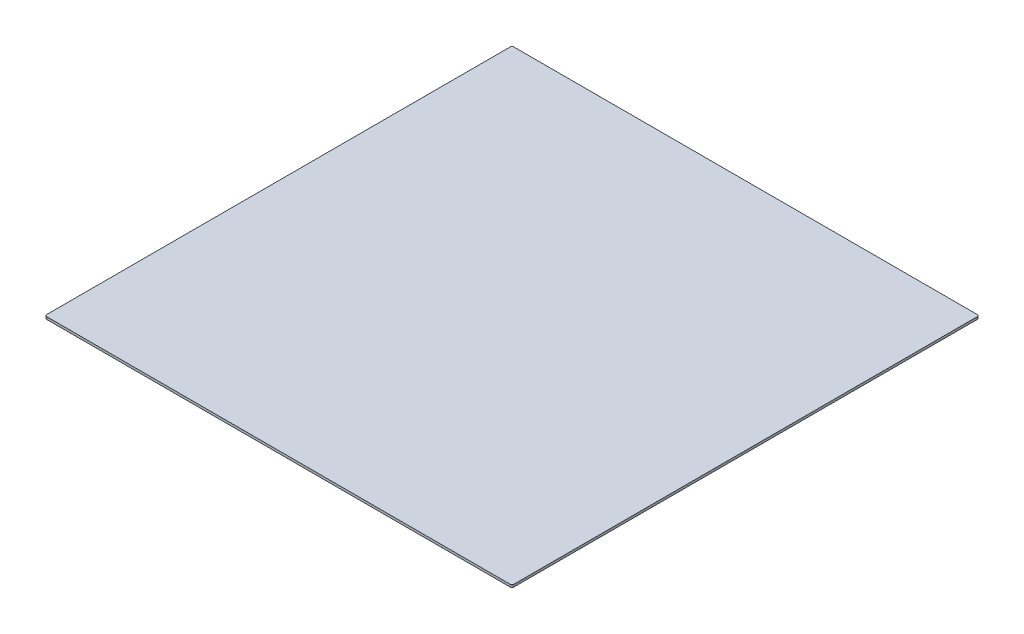
ISO-10303-21;
HEADER;
FILE_DESCRIPTION(('STEP AP214'),'2;1');
FILE_NAME('part.step','',(''),(''),'','','');
FILE_SCHEMA(('AUTOMOTIVE_DESIGN { 1 0 10303 214 1 1 1 1 }'));
ENDSEC;
DATA;
#1=APPLICATION_CONTEXT('core data for automotive mechanical design processes');
#2=APPLICATION_PROTOCOL_DEFINITION('international standard','automotive_design',2000,#1);
#3=PRODUCT_CONTEXT('',#1,'mechanical');
#4=PRODUCT('Part','Part','',(#3));
#5=PRODUCT_RELATED_PRODUCT_CATEGORY('part','',(#4));
#6=PRODUCT_DEFINITION_FORMATION('','',#4);
#7=PRODUCT_DEFINITION_CONTEXT('part definition',#1,'design');
#8=PRODUCT_DEFINITION('design','',#6,#7);
#9=PRODUCT_DEFINITION_SHAPE('','',#8);
#10=(LENGTH_UNIT() NAMED_UNIT(*) SI_UNIT(.MILLI.,.METRE.));
#11=(NAMED_UNIT(*) PLANE_ANGLE_UNIT() SI_UNIT($,.RADIAN.));
#12=(NAMED_UNIT(*) SI_UNIT($,.STERADIAN.) SOLID_ANGLE_UNIT());
#13=UNCERTAINTY_MEASURE_WITH_UNIT(LENGTH_MEASURE(1.E-05),#10,'distance_accuracy_value','');
#14=(GEOMETRIC_REPRESENTATION_CONTEXT(3) GLOBAL_UNCERTAINTY_ASSIGNED_CONTEXT((#13)) GLOBAL_UNIT_ASSIGNED_CONTEXT((#10,
#11,#12)) REPRESENTATION_CONTEXT('',''));
#15=CARTESIAN_POINT('',(0.,0.,0.));
#16=DIRECTION('',(0.,0.,1.));
#17=DIRECTION('',(1.,0.,0.));
#18=AXIS2_PLACEMENT_3D('',#15,#16,#17);
#19=CARTESIAN_POINT('',(1219.2,12.7,-1219.2));
#20=DIRECTION('',(-1.,0.,0.));
#21=DIRECTION('',(0.,0.,1.));
#22=AXIS2_PLACEMENT_3D('',#19,#20,#21);
#23=PLANE('',#22);
#24=DIRECTION('',(0.,0.,-1.));
#25=VECTOR('',#24,1.);
#26=CARTESIAN_POINT('',(1219.2,0.,-1219.2));
#27=LINE('',#26,#25);
#28=CARTESIAN_POINT('',(1219.2,0.,1209.2));
#29=VERTEX_POINT('',#28);
#30=CARTESIAN_POINT('',(1219.2,0.,-1209.2));
#31=VERTEX_POINT('',#30);
#32=EDGE_CURVE('E138',#29,#31,#27,.T.);
#33=ORIENTED_EDGE('',*,*,#32,.T.);
#34=DIRECTION('',(0.,-1.,0.));
#35=VECTOR('',#34,1.);
#36=CARTESIAN_POINT('',(1219.2,12.7,-1209.2));
#37=LINE('',#36,#35);
#38=CARTESIAN_POINT('',(1219.2,12.7,-1209.2));
#39=VERTEX_POINT('',#38);
#40=EDGE_CURVE('E160',#31,#39,#37,.F.);
#41=ORIENTED_EDGE('',*,*,#40,.T.);
#42=DIRECTION('',(0.,0.,-1.));
#43=VECTOR('',#42,1.);
#44=CARTESIAN_POINT('',(1219.2,12.7,-1219.2));
#45=LINE('',#44,#43);
#46=CARTESIAN_POINT('',(1219.2,12.7,1209.2));
#47=VERTEX_POINT('',#46);
#48=EDGE_CURVE('E136',#47,#39,#45,.T.);
#49=ORIENTED_EDGE('',*,*,#48,.F.);
#50=DIRECTION('',(0.,-1.,0.));
#51=VECTOR('',#50,1.);
#52=CARTESIAN_POINT('',(1219.2,12.7,1209.2));
#53=LINE('',#52,#51);
#54=EDGE_CURVE('E157',#47,#29,#53,.T.);
#55=ORIENTED_EDGE('',*,*,#54,.T.);
#56=EDGE_LOOP('',(#33,#41,#49,#55));
#57=FACE_BOUND('',#56,.T.);
#58=ADVANCED_FACE('F41',(#57),#23,.F.);
#59=CARTESIAN_POINT('',(-1219.2,12.7,-1219.2));
#60=DIRECTION('',(0.,0.,1.));
#61=DIRECTION('',(1.,0.,0.));
#62=AXIS2_PLACEMENT_3D('',#59,#60,#61);
#63=PLANE('',#62);
#64=DIRECTION('',(-1.,0.,0.));
#65=VECTOR('',#64,1.);
#66=CARTESIAN_POINT('',(-1219.2,0.,-1219.2));
#67=LINE('',#66,#65);
#68=CARTESIAN_POINT('',(1209.2,0.,-1219.2));
#69=VERTEX_POINT('',#68);
#70=CARTESIAN_POINT('',(-1209.2,0.,-1219.2));
#71=VERTEX_POINT('',#70);
#72=EDGE_CURVE('E134',#69,#71,#67,.T.);
#73=ORIENTED_EDGE('',*,*,#72,.T.);
#74=DIRECTION('',(0.,-1.,0.));
#75=VECTOR('',#74,1.);
#76=CARTESIAN_POINT('',(-1209.2,12.7,-1219.2));
#77=LINE('',#76,#75);
#78=CARTESIAN_POINT('',(-1209.2,12.7,-1219.2));
#79=VERTEX_POINT('',#78);
#80=EDGE_CURVE('E112',#71,#79,#77,.F.);
#81=ORIENTED_EDGE('',*,*,#80,.T.);
#82=DIRECTION('',(-1.,0.,0.));
#83=VECTOR('',#82,1.);
#84=CARTESIAN_POINT('',(-1219.2,12.7,-1219.2));
#85=LINE('',#84,#83);
#86=CARTESIAN_POINT('',(1209.2,12.7,-1219.2));
#87=VERTEX_POINT('',#86);
#88=EDGE_CURVE('E174',#87,#79,#85,.T.);
#89=ORIENTED_EDGE('',*,*,#88,.F.);
#90=DIRECTION('',(0.,-1.,0.));
#91=VECTOR('',#90,1.);
#92=CARTESIAN_POINT('',(1209.2,12.7,-1219.2));
#93=LINE('',#92,#91);
#94=EDGE_CURVE('E117',#87,#69,#93,.T.);
#95=ORIENTED_EDGE('',*,*,#94,.T.);
#96=EDGE_LOOP('',(#73,#81,#89,#95));
#97=FACE_BOUND('',#96,.T.);
#98=ADVANCED_FACE('F179',(#97),#63,.F.);
#99=CARTESIAN_POINT('',(-1219.2,12.7,-1219.2));
#100=DIRECTION('',(1.,0.,0.));
#101=DIRECTION('',(0.,0.,-1.));
#102=AXIS2_PLACEMENT_3D('',#99,#100,#101);
#103=PLANE('',#102);
#104=DIRECTION('',(0.,0.,1.));
#105=VECTOR('',#104,1.);
#106=CARTESIAN_POINT('',(-1219.2,12.7,-1219.2));
#107=LINE('',#106,#105);
#108=CARTESIAN_POINT('',(-1219.2,12.7,-1209.2));
#109=VERTEX_POINT('',#108);
#110=CARTESIAN_POINT('',(-1219.2,12.7,1209.2));
#111=VERTEX_POINT('',#110);
#112=EDGE_CURVE('E126',#109,#111,#107,.T.);
#113=ORIENTED_EDGE('',*,*,#112,.F.);
#114=DIRECTION('',(0.,-1.,0.));
#115=VECTOR('',#114,1.);
#116=CARTESIAN_POINT('',(-1219.2,12.7,-1209.2));
#117=LINE('',#116,#115);
#118=CARTESIAN_POINT('',(-1219.2,0.,-1209.2));
#119=VERTEX_POINT('',#118);
#120=EDGE_CURVE('E111',#109,#119,#117,.T.);
#121=ORIENTED_EDGE('',*,*,#120,.T.);
#122=DIRECTION('',(0.,0.,1.));
#123=VECTOR('',#122,1.);
#124=CARTESIAN_POINT('',(-1219.2,0.,-1219.2));
#125=LINE('',#124,#123);
#126=CARTESIAN_POINT('',(-1219.2,0.,1209.2));
#127=VERTEX_POINT('',#126);
#128=EDGE_CURVE('E124',#119,#127,#125,.T.);
#129=ORIENTED_EDGE('',*,*,#128,.T.);
#130=DIRECTION('',(0.,-1.,0.));
#131=VECTOR('',#130,1.);
#132=CARTESIAN_POINT('',(-1219.2,12.7,1209.2));
#133=LINE('',#132,#131);
#134=EDGE_CURVE('E128',#127,#111,#133,.F.);
#135=ORIENTED_EDGE('',*,*,#134,.T.);
#136=EDGE_LOOP('',(#113,#121,#129,#135));
#137=FACE_BOUND('',#136,.T.);
#138=ADVANCED_FACE('F123',(#137),#103,.F.);
#139=CARTESIAN_POINT('',(-1219.2,12.7,1219.2));
#140=DIRECTION('',(0.,0.,-1.));
#141=DIRECTION('',(-1.,0.,0.));
#142=AXIS2_PLACEMENT_3D('',#139,#140,#141);
#143=PLANE('',#142);
#144=DIRECTION('',(1.,0.,0.));
#145=VECTOR('',#144,1.);
#146=CARTESIAN_POINT('',(-1219.2,12.7,1219.2));
#147=LINE('',#146,#145);
#148=CARTESIAN_POINT('',(-1209.2,12.7,1219.2));
#149=VERTEX_POINT('',#148);
#150=CARTESIAN_POINT('',(1209.2,12.7,1219.2));
#151=VERTEX_POINT('',#150);
#152=EDGE_CURVE('E142',#149,#151,#147,.T.);
#153=ORIENTED_EDGE('',*,*,#152,.F.);
#154=DIRECTION('',(0.,-1.,0.));
#155=VECTOR('',#154,1.);
#156=CARTESIAN_POINT('',(-1209.2,12.7,1219.2));
#157=LINE('',#156,#155);
#158=CARTESIAN_POINT('',(-1209.2,0.,1219.2));
#159=VERTEX_POINT('',#158);
#160=EDGE_CURVE('E11',#149,#159,#157,.T.);
#161=ORIENTED_EDGE('',*,*,#160,.T.);
#162=DIRECTION('',(1.,0.,0.));
#163=VECTOR('',#162,1.);
#164=CARTESIAN_POINT('',(-1219.2,0.,1219.2));
#165=LINE('',#164,#163);
#166=CARTESIAN_POINT('',(1209.2,0.,1219.2));
#167=VERTEX_POINT('',#166);
#168=EDGE_CURVE('E133',#159,#167,#165,.T.);
#169=ORIENTED_EDGE('',*,*,#168,.T.);
#170=DIRECTION('',(0.,-1.,0.));
#171=VECTOR('',#170,1.);
#172=CARTESIAN_POINT('',(1209.2,12.7,1219.2));
#173=LINE('',#172,#171);
#174=EDGE_CURVE('E49',#167,#151,#173,.F.);
#175=ORIENTED_EDGE('',*,*,#174,.T.);
#176=EDGE_LOOP('',(#153,#161,#169,#175));
#177=FACE_BOUND('',#176,.T.);
#178=ADVANCED_FACE('F186',(#177),#143,.F.);
#179=CARTESIAN_POINT('',(0.,12.7,0.));
#180=DIRECTION('',(0.,1.,0.));
#181=DIRECTION('',(0.,0.,1.));
#182=AXIS2_PLACEMENT_3D('',#179,#180,#181);
#183=PLANE('',#182);
#184=ORIENTED_EDGE('',*,*,#88,.T.);
#185=CARTESIAN_POINT('',(-1209.2,12.7,-1209.2));
#186=DIRECTION('',(0.,1.,0.));
#187=DIRECTION('',(0.,0.,1.));
#188=AXIS2_PLACEMENT_3D('',#185,#186,#187);
#189=CIRCLE('',#188,10.);
#190=EDGE_CURVE('E155',#79,#109,#189,.T.);
#191=ORIENTED_EDGE('',*,*,#190,.T.);
#192=ORIENTED_EDGE('',*,*,#112,.T.);
#193=CARTESIAN_POINT('',(-1209.2,12.7,1209.2));
#194=DIRECTION('',(0.,1.,0.));
#195=DIRECTION('',(0.,0.,1.));
#196=AXIS2_PLACEMENT_3D('',#193,#194,#195);
#197=CIRCLE('',#196,10.);
#198=EDGE_CURVE('E62',#111,#149,#197,.T.);
#199=ORIENTED_EDGE('',*,*,#198,.T.);
#200=ORIENTED_EDGE('',*,*,#152,.T.);
#201=CARTESIAN_POINT('',(1209.2,12.7,1209.2));
#202=DIRECTION('',(0.,1.,0.));
#203=DIRECTION('',(0.,0.,1.));
#204=AXIS2_PLACEMENT_3D('',#201,#202,#203);
#205=CIRCLE('',#204,10.);
#206=EDGE_CURVE('E150',#151,#47,#205,.T.);
#207=ORIENTED_EDGE('',*,*,#206,.T.);
#208=ORIENTED_EDGE('',*,*,#48,.T.);
#209=CARTESIAN_POINT('',(1209.2,12.7,-1209.2));
#210=DIRECTION('',(0.,1.,0.));
#211=DIRECTION('',(0.,0.,1.));
#212=AXIS2_PLACEMENT_3D('',#209,#210,#211);
#213=CIRCLE('',#212,10.);
#214=EDGE_CURVE('E153',#39,#87,#213,.T.);
#215=ORIENTED_EDGE('',*,*,#214,.T.);
#216=EDGE_LOOP('',(#184,#191,#192,#199,#200,#207,#208,#215));
#217=FACE_BOUND('',#216,.T.);
#218=ADVANCED_FACE('F171',(#217),#183,.T.);
#219=CARTESIAN_POINT('',(0.,0.,0.));
#220=DIRECTION('',(0.,1.,0.));
#221=DIRECTION('',(0.,0.,1.));
#222=AXIS2_PLACEMENT_3D('',#219,#220,#221);
#223=PLANE('',#222);
#224=ORIENTED_EDGE('',*,*,#128,.F.);
#225=CARTESIAN_POINT('',(-1209.2,0.,-1209.2));
#226=DIRECTION('',(0.,1.,0.));
#227=DIRECTION('',(0.,0.,1.));
#228=AXIS2_PLACEMENT_3D('',#225,#226,#227);
#229=CIRCLE('',#228,10.);
#230=EDGE_CURVE('E107',#119,#71,#229,.F.);
#231=ORIENTED_EDGE('',*,*,#230,.T.);
#232=ORIENTED_EDGE('',*,*,#72,.F.);
#233=CARTESIAN_POINT('',(1209.2,0.,-1209.2));
#234=DIRECTION('',(0.,1.,0.));
#235=DIRECTION('',(0.,0.,1.));
#236=AXIS2_PLACEMENT_3D('',#233,#234,#235);
#237=CIRCLE('',#236,10.);
#238=EDGE_CURVE('E118',#69,#31,#237,.F.);
#239=ORIENTED_EDGE('',*,*,#238,.T.);
#240=ORIENTED_EDGE('',*,*,#32,.F.);
#241=CARTESIAN_POINT('',(1209.2,0.,1209.2));
#242=DIRECTION('',(0.,1.,0.));
#243=DIRECTION('',(0.,0.,1.));
#244=AXIS2_PLACEMENT_3D('',#241,#242,#243);
#245=CIRCLE('',#244,10.);
#246=EDGE_CURVE('E127',#29,#167,#245,.F.);
#247=ORIENTED_EDGE('',*,*,#246,.T.);
#248=ORIENTED_EDGE('',*,*,#168,.F.);
#249=CARTESIAN_POINT('',(-1209.2,0.,1209.2));
#250=DIRECTION('',(0.,1.,0.));
#251=DIRECTION('',(0.,0.,1.));
#252=AXIS2_PLACEMENT_3D('',#249,#250,#251);
#253=CIRCLE('',#252,10.);
#254=EDGE_CURVE('E132',#159,#127,#253,.F.);
#255=ORIENTED_EDGE('',*,*,#254,.T.);
#256=EDGE_LOOP('',(#224,#231,#232,#239,#240,#247,#248,#255));
#257=FACE_BOUND('',#256,.T.);
#258=ADVANCED_FACE('F130',(#257),#223,.F.);
#259=CARTESIAN_POINT('',(-1209.2,12.7,-1209.2));
#260=DIRECTION('',(0.,-1.,0.));
#261=DIRECTION('',(0.,0.,-1.));
#262=AXIS2_PLACEMENT_3D('',#259,#260,#261);
#263=CYLINDRICAL_SURFACE('',#262,10.);
#264=ORIENTED_EDGE('',*,*,#190,.F.);
#265=ORIENTED_EDGE('',*,*,#80,.F.);
#266=ORIENTED_EDGE('',*,*,#230,.F.);
#267=ORIENTED_EDGE('',*,*,#120,.F.);
#268=EDGE_LOOP('',(#264,#265,#266,#267));
#269=FACE_BOUND('',#268,.T.);
#270=ADVANCED_FACE('F110',(#269),#263,.T.);
#271=CARTESIAN_POINT('',(1209.2,12.7,-1209.2));
#272=DIRECTION('',(0.,-1.,0.));
#273=DIRECTION('',(0.,0.,-1.));
#274=AXIS2_PLACEMENT_3D('',#271,#272,#273);
#275=CYLINDRICAL_SURFACE('',#274,10.);
#276=ORIENTED_EDGE('',*,*,#214,.F.);
#277=ORIENTED_EDGE('',*,*,#40,.F.);
#278=ORIENTED_EDGE('',*,*,#238,.F.);
#279=ORIENTED_EDGE('',*,*,#94,.F.);
#280=EDGE_LOOP('',(#276,#277,#278,#279));
#281=FACE_BOUND('',#280,.T.);
#282=ADVANCED_FACE('F177',(#281),#275,.T.);
#283=CARTESIAN_POINT('',(-1209.2,12.7,1209.2));
#284=DIRECTION('',(0.,-1.,0.));
#285=DIRECTION('',(0.,0.,-1.));
#286=AXIS2_PLACEMENT_3D('',#283,#284,#285);
#287=CYLINDRICAL_SURFACE('',#286,10.);
#288=ORIENTED_EDGE('',*,*,#198,.F.);
#289=ORIENTED_EDGE('',*,*,#134,.F.);
#290=ORIENTED_EDGE('',*,*,#254,.F.);
#291=ORIENTED_EDGE('',*,*,#160,.F.);
#292=EDGE_LOOP('',(#288,#289,#290,#291));
#293=FACE_BOUND('',#292,.T.);
#294=ADVANCED_FACE('F185',(#293),#287,.T.);
#295=CARTESIAN_POINT('',(1209.2,12.7,1209.2));
#296=DIRECTION('',(0.,-1.,0.));
#297=DIRECTION('',(0.,0.,-1.));
#298=AXIS2_PLACEMENT_3D('',#295,#296,#297);
#299=CYLINDRICAL_SURFACE('',#298,10.);
#300=ORIENTED_EDGE('',*,*,#206,.F.);
#301=ORIENTED_EDGE('',*,*,#174,.F.);
#302=ORIENTED_EDGE('',*,*,#246,.F.);
#303=ORIENTED_EDGE('',*,*,#54,.F.);
#304=EDGE_LOOP('',(#300,#301,#302,#303));
#305=FACE_BOUND('',#304,.T.);
#306=ADVANCED_FACE('F43',(#305),#299,.T.);
#307=CLOSED_SHELL('',(#58,#98,#138,#178,#218,#258,#270,#282,#294,#306));
#308=MANIFOLD_SOLID_BREP('B2',#307);
#309=ADVANCED_BREP_SHAPE_REPRESENTATION('',(#18,#308),#14);
#310=SHAPE_DEFINITION_REPRESENTATION(#9,#309);
ENDSEC;
END-ISO-10303-21;
